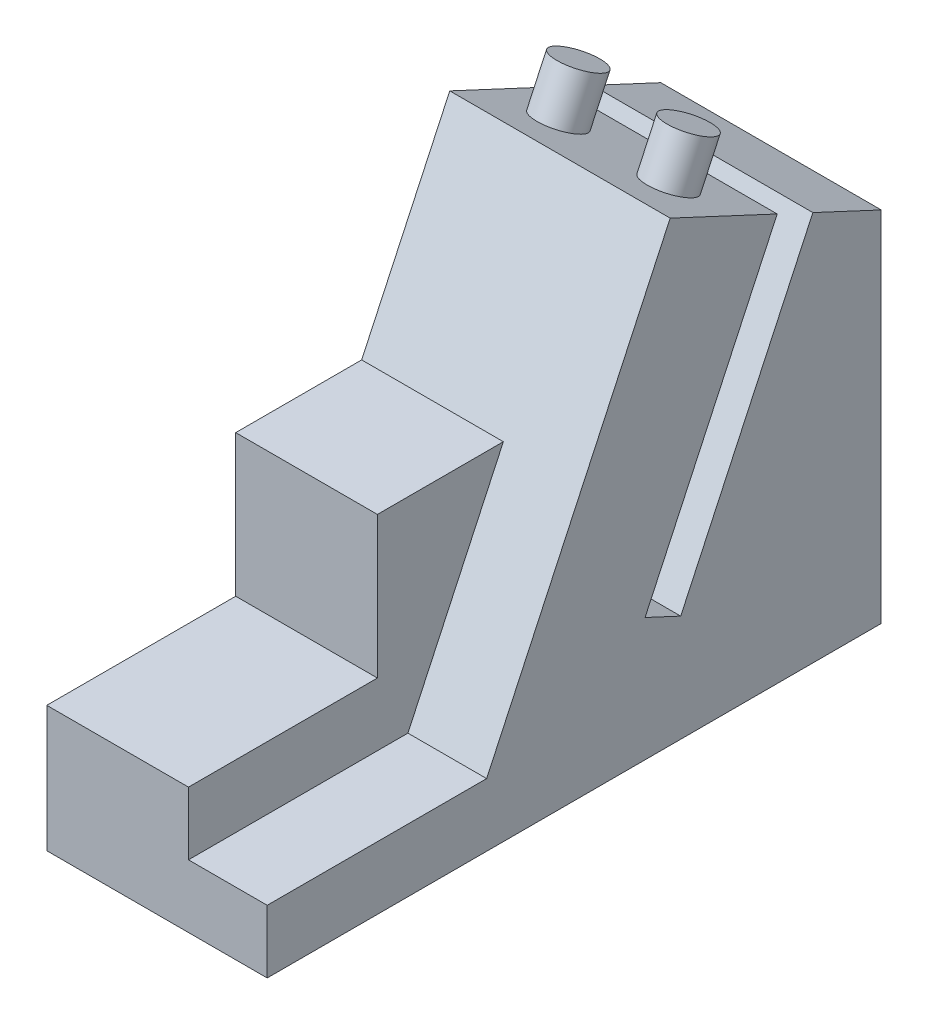
ISO-10303-21;
HEADER;
FILE_DESCRIPTION(('STEP AP214'),'2;1');
FILE_NAME('part.step','',(''),(''),'','','');
FILE_SCHEMA(('AUTOMOTIVE_DESIGN { 1 0 10303 214 1 1 1 1 }'));
ENDSEC;
DATA;
#1=APPLICATION_CONTEXT('core data for automotive mechanical design processes');
#2=APPLICATION_PROTOCOL_DEFINITION('international standard','automotive_design',2000,#1);
#3=PRODUCT_CONTEXT('',#1,'mechanical');
#4=PRODUCT('Part','Part','',(#3));
#5=PRODUCT_RELATED_PRODUCT_CATEGORY('part','',(#4));
#6=PRODUCT_DEFINITION_FORMATION('','',#4);
#7=PRODUCT_DEFINITION_CONTEXT('part definition',#1,'design');
#8=PRODUCT_DEFINITION('design','',#6,#7);
#9=PRODUCT_DEFINITION_SHAPE('','',#8);
#10=(LENGTH_UNIT() NAMED_UNIT(*) SI_UNIT(.MILLI.,.METRE.));
#11=(NAMED_UNIT(*) PLANE_ANGLE_UNIT() SI_UNIT($,.RADIAN.));
#12=(NAMED_UNIT(*) SI_UNIT($,.STERADIAN.) SOLID_ANGLE_UNIT());
#13=UNCERTAINTY_MEASURE_WITH_UNIT(LENGTH_MEASURE(1.E-05),#10,'distance_accuracy_value','');
#14=(GEOMETRIC_REPRESENTATION_CONTEXT(3) GLOBAL_UNCERTAINTY_ASSIGNED_CONTEXT((#13)) GLOBAL_UNIT_ASSIGNED_CONTEXT((#10,
#11,#12)) REPRESENTATION_CONTEXT('',''));
#15=CARTESIAN_POINT('',(0.,0.,0.));
#16=DIRECTION('',(0.,0.,1.));
#17=DIRECTION('',(1.,0.,0.));
#18=AXIS2_PLACEMENT_3D('',#15,#16,#17);
#19=CARTESIAN_POINT('',(0.,34.,0.));
#20=DIRECTION('',(0.,-1.,0.));
#21=DIRECTION('',(0.,0.,-1.));
#22=AXIS2_PLACEMENT_3D('',#19,#20,#21);
#23=PLANE('',#22);
#24=DIRECTION('',(0.,0.,-1.));
#25=VECTOR('',#24,1.);
#26=CARTESIAN_POINT('',(18.,34.,0.));
#27=LINE('',#26,#25);
#28=CARTESIAN_POINT('',(18.,34.,-24.));
#29=VERTEX_POINT('',#28);
#30=CARTESIAN_POINT('',(18.,34.,-40.));
#31=VERTEX_POINT('',#30);
#32=EDGE_CURVE('E108',#29,#31,#27,.T.);
#33=ORIENTED_EDGE('',*,*,#32,.T.);
#34=DIRECTION('',(1.,0.,0.));
#35=VECTOR('',#34,1.);
#36=CARTESIAN_POINT('',(0.,34.,-40.));
#37=LINE('',#36,#35);
#38=CARTESIAN_POINT('',(0.,34.,-40.));
#39=VERTEX_POINT('',#38);
#40=EDGE_CURVE('E232',#39,#31,#37,.T.);
#41=ORIENTED_EDGE('',*,*,#40,.F.);
#42=DIRECTION('',(0.,0.,-1.));
#43=VECTOR('',#42,1.);
#44=CARTESIAN_POINT('',(0.,34.,0.));
#45=LINE('',#44,#43);
#46=CARTESIAN_POINT('',(0.,34.,-24.));
#47=VERTEX_POINT('',#46);
#48=EDGE_CURVE('E299',#47,#39,#45,.T.);
#49=ORIENTED_EDGE('',*,*,#48,.F.);
#50=DIRECTION('',(1.,0.,0.));
#51=VECTOR('',#50,1.);
#52=CARTESIAN_POINT('',(0.,34.,-24.));
#53=LINE('',#52,#51);
#54=EDGE_CURVE('E217',#47,#29,#53,.T.);
#55=ORIENTED_EDGE('',*,*,#54,.T.);
#56=EDGE_LOOP('',(#33,#41,#49,#55));
#57=FACE_BOUND('',#56,.T.);
#58=ADVANCED_FACE('F92',(#57),#23,.F.);
#59=CARTESIAN_POINT('',(0.,16.,0.));
#60=DIRECTION('',(0.,-1.,0.));
#61=DIRECTION('',(0.,0.,-1.));
#62=AXIS2_PLACEMENT_3D('',#59,#60,#61);
#63=PLANE('',#62);
#64=DIRECTION('',(0.,0.,-1.));
#65=VECTOR('',#64,1.);
#66=CARTESIAN_POINT('',(18.,16.,0.));
#67=LINE('',#66,#65);
#68=CARTESIAN_POINT('',(18.,16.,0.));
#69=VERTEX_POINT('',#68);
#70=CARTESIAN_POINT('',(18.,16.,-24.));
#71=VERTEX_POINT('',#70);
#72=EDGE_CURVE('E195',#69,#71,#67,.T.);
#73=ORIENTED_EDGE('',*,*,#72,.T.);
#74=DIRECTION('',(1.,0.,0.));
#75=VECTOR('',#74,1.);
#76=CARTESIAN_POINT('',(0.,16.,-24.));
#77=LINE('',#76,#75);
#78=CARTESIAN_POINT('',(0.,16.,-24.));
#79=VERTEX_POINT('',#78);
#80=EDGE_CURVE('E205',#79,#71,#77,.T.);
#81=ORIENTED_EDGE('',*,*,#80,.F.);
#82=DIRECTION('',(0.,0.,-1.));
#83=VECTOR('',#82,1.);
#84=CARTESIAN_POINT('',(0.,16.,0.));
#85=LINE('',#84,#83);
#86=CARTESIAN_POINT('',(0.,16.,0.));
#87=VERTEX_POINT('',#86);
#88=EDGE_CURVE('E338',#87,#79,#85,.T.);
#89=ORIENTED_EDGE('',*,*,#88,.F.);
#90=DIRECTION('',(1.,0.,0.));
#91=VECTOR('',#90,1.);
#92=CARTESIAN_POINT('',(0.,16.,0.));
#93=LINE('',#92,#91);
#94=EDGE_CURVE('E208',#87,#69,#93,.T.);
#95=ORIENTED_EDGE('',*,*,#94,.T.);
#96=EDGE_LOOP('',(#73,#81,#89,#95));
#97=FACE_BOUND('',#96,.T.);
#98=ADVANCED_FACE('F204',(#97),#63,.F.);
#99=CARTESIAN_POINT('',(0.,0.,-24.));
#100=DIRECTION('',(0.,0.,-1.));
#101=DIRECTION('',(-1.,0.,0.));
#102=AXIS2_PLACEMENT_3D('',#99,#100,#101);
#103=PLANE('',#102);
#104=DIRECTION('',(0.,1.,0.));
#105=VECTOR('',#104,1.);
#106=CARTESIAN_POINT('',(18.,0.,-24.));
#107=LINE('',#106,#105);
#108=EDGE_CURVE('E191',#71,#29,#107,.T.);
#109=ORIENTED_EDGE('',*,*,#108,.T.);
#110=ORIENTED_EDGE('',*,*,#54,.F.);
#111=DIRECTION('',(0.,1.,0.));
#112=VECTOR('',#111,1.);
#113=CARTESIAN_POINT('',(0.,0.,-24.));
#114=LINE('',#113,#112);
#115=EDGE_CURVE('E214',#79,#47,#114,.T.);
#116=ORIENTED_EDGE('',*,*,#115,.F.);
#117=ORIENTED_EDGE('',*,*,#80,.T.);
#118=EDGE_LOOP('',(#109,#110,#116,#117));
#119=FACE_BOUND('',#118,.T.);
#120=ADVANCED_FACE('F212',(#119),#103,.F.);
#121=CARTESIAN_POINT('',(0.,58.,0.));
#122=DIRECTION('',(1.,0.,0.));
#123=DIRECTION('',(0.,0.,-1.));
#124=AXIS2_PLACEMENT_3D('',#121,#122,#123);
#125=PLANE('',#124);
#126=DIRECTION('',(0.,-0.906307787036651,0.422618261740697));
#127=VECTOR('',#126,1.);
#128=CARTESIAN_POINT('',(0.,-17.7006434618647,-37.9591524014413));
#129=LINE('',#128,#127);
#130=CARTESIAN_POINT('',(0.,49.5476347651861,-69.3175395364529));
#131=VERTEX_POINT('',#130);
#132=CARTESIAN_POINT('',(0.,13.5476347651861,-52.5304638428731));
#133=VERTEX_POINT('',#132);
#134=EDGE_CURVE('E336',#131,#133,#129,.T.);
#135=ORIENTED_EDGE('',*,*,#134,.F.);
#136=DIRECTION('',(0.,-0.422618261740697,-0.906307787036651));
#137=VECTOR('',#136,1.);
#138=CARTESIAN_POINT('',(0.,67.2482782270507,-31.3583871350116));
#139=LINE('',#138,#137);
#140=CARTESIAN_POINT('',(0.,45.4989369594061,-78.));
#141=VERTEX_POINT('',#140);
#142=EDGE_CURVE('E333',#131,#141,#139,.T.);
#143=ORIENTED_EDGE('',*,*,#142,.T.);
#144=DIRECTION('',(0.,-1.,0.));
#145=VECTOR('',#144,1.);
#146=CARTESIAN_POINT('',(0.,58.,-78.));
#147=LINE('',#146,#145);
#148=CARTESIAN_POINT('',(0.,0.,-78.));
#149=VERTEX_POINT('',#148);
#150=EDGE_CURVE('E244',#141,#149,#147,.T.);
#151=ORIENTED_EDGE('',*,*,#150,.T.);
#152=DIRECTION('',(0.,0.,1.));
#153=VECTOR('',#152,1.);
#154=CARTESIAN_POINT('',(0.,0.,0.));
#155=LINE('',#154,#153);
#156=CARTESIAN_POINT('',(0.,0.,0.));
#157=VERTEX_POINT('',#156);
#158=EDGE_CURVE('E227',#149,#157,#155,.T.);
#159=ORIENTED_EDGE('',*,*,#158,.T.);
#160=DIRECTION('',(0.,-1.,0.));
#161=VECTOR('',#160,1.);
#162=CARTESIAN_POINT('',(0.,58.,0.));
#163=LINE('',#162,#161);
#164=EDGE_CURVE('E253',#87,#157,#163,.T.);
#165=ORIENTED_EDGE('',*,*,#164,.F.);
#166=ORIENTED_EDGE('',*,*,#88,.T.);
#167=ORIENTED_EDGE('',*,*,#115,.T.);
#168=ORIENTED_EDGE('',*,*,#48,.T.);
#169=DIRECTION('',(0.,0.906307787036651,-0.422618261740697));
#170=VECTOR('',#169,1.);
#171=CARTESIAN_POINT('',(0.,-9.24827822705073,-19.8329966607083));
#172=LINE('',#171,#170);
#173=CARTESIAN_POINT('',(0.,58.,-51.1913837957199));
#174=VERTEX_POINT('',#173);
#175=EDGE_CURVE('E223',#39,#174,#172,.T.);
#176=ORIENTED_EDGE('',*,*,#175,.T.);
#177=CARTESIAN_POINT('',(0.,51.6607260738896,-64.7860006012697));
#178=VERTEX_POINT('',#177);
#179=EDGE_CURVE('E340',#174,#178,#139,.T.);
#180=ORIENTED_EDGE('',*,*,#179,.T.);
#181=DIRECTION('',(0.,-0.906307787036651,0.422618261740697));
#182=VECTOR('',#181,1.);
#183=CARTESIAN_POINT('',(0.,-15.5875521531612,-33.427613466258));
#184=LINE('',#183,#182);
#185=CARTESIAN_POINT('',(0.,15.6607260738896,-47.9989249076898));
#186=VERTEX_POINT('',#185);
#187=EDGE_CURVE('E348',#178,#186,#184,.T.);
#188=ORIENTED_EDGE('',*,*,#187,.T.);
#189=DIRECTION('',(0.,-0.422618261740697,-0.906307787036651));
#190=VECTOR('',#189,1.);
#191=CARTESIAN_POINT('',(0.,31.2482782270507,-14.5713114414317));
#192=LINE('',#191,#190);
#193=EDGE_CURVE('E343',#186,#133,#192,.T.);
#194=ORIENTED_EDGE('',*,*,#193,.T.);
#195=EDGE_LOOP('',(#135,#143,#151,#159,#165,#166,#167,#168,#176,#180,#188,#194));
#196=FACE_BOUND('',#195,.T.);
#197=ADVANCED_FACE('F94',(#196),#125,.F.);
#198=CARTESIAN_POINT('',(0.,58.,0.));
#199=DIRECTION('',(0.,0.,-1.));
#200=DIRECTION('',(-1.,0.,0.));
#201=AXIS2_PLACEMENT_3D('',#198,#199,#200);
#202=PLANE('',#201);
#203=DIRECTION('',(0.,-1.,0.));
#204=VECTOR('',#203,1.);
#205=CARTESIAN_POINT('',(28.,58.,0.));
#206=LINE('',#205,#204);
#207=CARTESIAN_POINT('',(28.,8.,0.));
#208=VERTEX_POINT('',#207);
#209=CARTESIAN_POINT('',(28.,0.,0.));
#210=VERTEX_POINT('',#209);
#211=EDGE_CURVE('E250',#208,#210,#206,.T.);
#212=ORIENTED_EDGE('',*,*,#211,.F.);
#213=DIRECTION('',(1.,0.,0.));
#214=VECTOR('',#213,1.);
#215=CARTESIAN_POINT('',(18.,8.,0.));
#216=LINE('',#215,#214);
#217=CARTESIAN_POINT('',(18.,8.,0.));
#218=VERTEX_POINT('',#217);
#219=EDGE_CURVE('E393',#218,#208,#216,.T.);
#220=ORIENTED_EDGE('',*,*,#219,.F.);
#221=DIRECTION('',(0.,-1.,0.));
#222=VECTOR('',#221,1.);
#223=CARTESIAN_POINT('',(18.,0.,0.));
#224=LINE('',#223,#222);
#225=EDGE_CURVE('E210',#69,#218,#224,.T.);
#226=ORIENTED_EDGE('',*,*,#225,.F.);
#227=ORIENTED_EDGE('',*,*,#94,.F.);
#228=ORIENTED_EDGE('',*,*,#164,.T.);
#229=DIRECTION('',(1.,0.,0.));
#230=VECTOR('',#229,1.);
#231=CARTESIAN_POINT('',(0.,0.,0.));
#232=LINE('',#231,#230);
#233=EDGE_CURVE('E231',#157,#210,#232,.T.);
#234=ORIENTED_EDGE('',*,*,#233,.T.);
#235=EDGE_LOOP('',(#212,#220,#226,#227,#228,#234));
#236=FACE_BOUND('',#235,.T.);
#237=ADVANCED_FACE('F386',(#236),#202,.F.);
#238=CARTESIAN_POINT('',(28.,58.,0.));
#239=DIRECTION('',(-1.,0.,0.));
#240=DIRECTION('',(0.,0.,1.));
#241=AXIS2_PLACEMENT_3D('',#238,#239,#240);
#242=PLANE('',#241);
#243=DIRECTION('',(0.,0.906307787036651,-0.422618261740697));
#244=VECTOR('',#243,1.);
#245=CARTESIAN_POINT('',(28.,-9.24827822705073,-19.8329966607083));
#246=LINE('',#245,#244);
#247=CARTESIAN_POINT('',(28.,8.,-27.8760008879701));
#248=VERTEX_POINT('',#247);
#249=CARTESIAN_POINT('',(28.,58.,-51.1913837957199));
#250=VERTEX_POINT('',#249);
#251=EDGE_CURVE('E280',#248,#250,#246,.T.);
#252=ORIENTED_EDGE('',*,*,#251,.F.);
#253=DIRECTION('',(0.,0.,-1.));
#254=VECTOR('',#253,1.);
#255=CARTESIAN_POINT('',(28.,8.,0.));
#256=LINE('',#255,#254);
#257=EDGE_CURVE('E404',#208,#248,#256,.T.);
#258=ORIENTED_EDGE('',*,*,#257,.F.);
#259=ORIENTED_EDGE('',*,*,#211,.T.);
#260=DIRECTION('',(0.,0.,-1.));
#261=VECTOR('',#260,1.);
#262=CARTESIAN_POINT('',(28.,0.,0.));
#263=LINE('',#262,#261);
#264=CARTESIAN_POINT('',(28.,0.,-78.));
#265=VERTEX_POINT('',#264);
#266=EDGE_CURVE('E236',#210,#265,#263,.T.);
#267=ORIENTED_EDGE('',*,*,#266,.T.);
#268=DIRECTION('',(0.,-1.,0.));
#269=VECTOR('',#268,1.);
#270=CARTESIAN_POINT('',(28.,58.,-78.));
#271=LINE('',#270,#269);
#272=CARTESIAN_POINT('',(28.,45.4989369594061,-78.));
#273=VERTEX_POINT('',#272);
#274=EDGE_CURVE('E247',#273,#265,#271,.T.);
#275=ORIENTED_EDGE('',*,*,#274,.F.);
#276=DIRECTION('',(0.,-0.422618261740697,-0.906307787036651));
#277=VECTOR('',#276,1.);
#278=CARTESIAN_POINT('',(28.,67.2482782270507,-31.3583871350116));
#279=LINE('',#278,#277);
#280=CARTESIAN_POINT('',(28.,49.5476347651861,-69.3175395364529));
#281=VERTEX_POINT('',#280);
#282=EDGE_CURVE('E116',#281,#273,#279,.T.);
#283=ORIENTED_EDGE('',*,*,#282,.F.);
#284=DIRECTION('',(0.,-0.906307787036651,0.422618261740697));
#285=VECTOR('',#284,1.);
#286=CARTESIAN_POINT('',(28.,-17.7006434618647,-37.9591524014413));
#287=LINE('',#286,#285);
#288=CARTESIAN_POINT('',(28.,13.5476347651861,-52.5304638428731));
#289=VERTEX_POINT('',#288);
#290=EDGE_CURVE('E293',#281,#289,#287,.T.);
#291=ORIENTED_EDGE('',*,*,#290,.T.);
#292=DIRECTION('',(0.,-0.422618261740697,-0.906307787036651));
#293=VECTOR('',#292,1.);
#294=CARTESIAN_POINT('',(28.,31.2482782270507,-14.5713114414317));
#295=LINE('',#294,#293);
#296=CARTESIAN_POINT('',(28.,15.6607260738896,-47.9989249076898));
#297=VERTEX_POINT('',#296);
#298=EDGE_CURVE('E288',#297,#289,#295,.T.);
#299=ORIENTED_EDGE('',*,*,#298,.F.);
#300=DIRECTION('',(0.,-0.906307787036651,0.422618261740697));
#301=VECTOR('',#300,1.);
#302=CARTESIAN_POINT('',(28.,-15.5875521531612,-33.427613466258));
#303=LINE('',#302,#301);
#304=CARTESIAN_POINT('',(28.,51.6607260738896,-64.7860006012697));
#305=VERTEX_POINT('',#304);
#306=EDGE_CURVE('E281',#305,#297,#303,.T.);
#307=ORIENTED_EDGE('',*,*,#306,.F.);
#308=EDGE_CURVE('E271',#250,#305,#279,.T.);
#309=ORIENTED_EDGE('',*,*,#308,.F.);
#310=EDGE_LOOP('',(#252,#258,#259,#267,#275,#283,#291,#299,#307,#309));
#311=FACE_BOUND('',#310,.T.);
#312=ADVANCED_FACE('F285',(#311),#242,.F.);
#313=CARTESIAN_POINT('',(0.,58.,-78.));
#314=DIRECTION('',(0.,0.,1.));
#315=DIRECTION('',(1.,0.,0.));
#316=AXIS2_PLACEMENT_3D('',#313,#314,#315);
#317=PLANE('',#316);
#318=ORIENTED_EDGE('',*,*,#150,.F.);
#319=DIRECTION('',(1.,0.,0.));
#320=VECTOR('',#319,1.);
#321=CARTESIAN_POINT('',(0.,45.4989369594061,-78.));
#322=LINE('',#321,#320);
#323=EDGE_CURVE('E221',#141,#273,#322,.T.);
#324=ORIENTED_EDGE('',*,*,#323,.T.);
#325=ORIENTED_EDGE('',*,*,#274,.T.);
#326=DIRECTION('',(-1.,0.,0.));
#327=VECTOR('',#326,1.);
#328=CARTESIAN_POINT('',(0.,0.,-78.));
#329=LINE('',#328,#327);
#330=EDGE_CURVE('E240',#265,#149,#329,.T.);
#331=ORIENTED_EDGE('',*,*,#330,.T.);
#332=EDGE_LOOP('',(#318,#324,#325,#331));
#333=FACE_BOUND('',#332,.T.);
#334=ADVANCED_FACE('F319',(#333),#317,.F.);
#335=CARTESIAN_POINT('',(0.,0.,0.));
#336=DIRECTION('',(0.,-1.,0.));
#337=DIRECTION('',(0.,0.,-1.));
#338=AXIS2_PLACEMENT_3D('',#335,#336,#337);
#339=PLANE('',#338);
#340=ORIENTED_EDGE('',*,*,#158,.F.);
#341=ORIENTED_EDGE('',*,*,#330,.F.);
#342=ORIENTED_EDGE('',*,*,#266,.F.);
#343=ORIENTED_EDGE('',*,*,#233,.F.);
#344=EDGE_LOOP('',(#340,#341,#342,#343));
#345=FACE_BOUND('',#344,.T.);
#346=ADVANCED_FACE('F329',(#345),#339,.T.);
#347=CARTESIAN_POINT('',(0.,-9.24827822705073,-19.8329966607083));
#348=DIRECTION('',(0.,-0.422618261740697,-0.906307787036651));
#349=DIRECTION('',(0.,0.906307787036651,-0.422618261740697));
#350=AXIS2_PLACEMENT_3D('',#347,#348,#349);
#351=PLANE('',#350);
#352=ORIENTED_EDGE('',*,*,#251,.T.);
#353=DIRECTION('',(1.,0.,0.));
#354=VECTOR('',#353,1.);
#355=CARTESIAN_POINT('',(0.,58.,-51.1913837957199));
#356=LINE('',#355,#354);
#357=EDGE_CURVE('E276',#174,#250,#356,.T.);
#358=ORIENTED_EDGE('',*,*,#357,.F.);
#359=ORIENTED_EDGE('',*,*,#175,.F.);
#360=ORIENTED_EDGE('',*,*,#40,.T.);
#361=DIRECTION('',(0.,0.906307787036651,-0.422618261740697));
#362=VECTOR('',#361,1.);
#363=CARTESIAN_POINT('',(18.,-9.24827822705073,-19.8329966607083));
#364=LINE('',#363,#362);
#365=CARTESIAN_POINT('',(18.,8.,-27.8760008879701));
#366=VERTEX_POINT('',#365);
#367=EDGE_CURVE('E399',#366,#31,#364,.T.);
#368=ORIENTED_EDGE('',*,*,#367,.F.);
#369=DIRECTION('',(1.,0.,0.));
#370=VECTOR('',#369,1.);
#371=CARTESIAN_POINT('',(18.,8.,-27.8760008879701));
#372=LINE('',#371,#370);
#373=EDGE_CURVE('E358',#366,#248,#372,.T.);
#374=ORIENTED_EDGE('',*,*,#373,.T.);
#375=EDGE_LOOP('',(#352,#358,#359,#360,#368,#374));
#376=FACE_BOUND('',#375,.T.);
#377=ADVANCED_FACE('F265',(#376),#351,.F.);
#378=CARTESIAN_POINT('',(0.,67.2482782270507,-31.3583871350116));
#379=DIRECTION('',(0.,-0.906307787036651,0.422618261740697));
#380=DIRECTION('',(0.,-0.422618261740697,-0.906307787036651));
#381=AXIS2_PLACEMENT_3D('',#378,#379,#380);
#382=PLANE('',#381);
#383=CARTESIAN_POINT('',(21.,54.8303630369448,-57.9886921984948));
#384=DIRECTION('',(0.,-0.906307787036651,0.422618261740697));
#385=DIRECTION('',(0.,-0.422618261740697,-0.906307787036651));
#386=AXIS2_PLACEMENT_3D('',#383,#384,#385);
#387=CIRCLE('',#386,3.);
#388=CARTESIAN_POINT('',(21.,53.5625082517227,-60.7076155596047));
#389=VERTEX_POINT('',#388);
#390=EDGE_CURVE('E13',#389,#389,#387,.F.);
#391=ORIENTED_EDGE('',*,*,#390,.F.);
#392=EDGE_LOOP('',(#391));
#393=FACE_BOUND('',#392,.T.);
#394=CARTESIAN_POINT('',(7.,54.8303630369448,-57.9886921984948));
#395=DIRECTION('',(0.,-0.906307787036651,0.422618261740697));
#396=DIRECTION('',(0.,-0.422618261740697,-0.906307787036651));
#397=AXIS2_PLACEMENT_3D('',#394,#395,#396);
#398=CIRCLE('',#397,3.);
#399=CARTESIAN_POINT('',(7.,53.5625082517227,-60.7076155596047));
#400=VERTEX_POINT('',#399);
#401=EDGE_CURVE('E101',#400,#400,#398,.F.);
#402=ORIENTED_EDGE('',*,*,#401,.F.);
#403=EDGE_LOOP('',(#402));
#404=FACE_BOUND('',#403,.T.);
#405=ORIENTED_EDGE('',*,*,#308,.T.);
#406=DIRECTION('',(1.,0.,0.));
#407=VECTOR('',#406,1.);
#408=CARTESIAN_POINT('',(0.,51.6607260738896,-64.7860006012697));
#409=LINE('',#408,#407);
#410=EDGE_CURVE('E274',#178,#305,#409,.T.);
#411=ORIENTED_EDGE('',*,*,#410,.F.);
#412=ORIENTED_EDGE('',*,*,#179,.F.);
#413=ORIENTED_EDGE('',*,*,#357,.T.);
#414=EDGE_LOOP('',(#405,#411,#412,#413));
#415=FACE_BOUND('',#414,.T.);
#416=ADVANCED_FACE('F261',(#393,#404,#415),#382,.F.);
#417=CARTESIAN_POINT('',(0.,-15.5875521531612,-33.427613466258));
#418=DIRECTION('',(0.,0.422618261740697,0.906307787036651));
#419=DIRECTION('',(0.,-0.906307787036651,0.422618261740697));
#420=AXIS2_PLACEMENT_3D('',#417,#418,#419);
#421=PLANE('',#420);
#422=ORIENTED_EDGE('',*,*,#306,.T.);
#423=DIRECTION('',(1.,0.,0.));
#424=VECTOR('',#423,1.);
#425=CARTESIAN_POINT('',(0.,15.6607260738896,-47.9989249076898));
#426=LINE('',#425,#424);
#427=EDGE_CURVE('E307',#186,#297,#426,.T.);
#428=ORIENTED_EDGE('',*,*,#427,.F.);
#429=ORIENTED_EDGE('',*,*,#187,.F.);
#430=ORIENTED_EDGE('',*,*,#410,.T.);
#431=EDGE_LOOP('',(#422,#428,#429,#430));
#432=FACE_BOUND('',#431,.T.);
#433=ADVANCED_FACE('F264',(#432),#421,.F.);
#434=CARTESIAN_POINT('',(0.,31.2482782270507,-14.5713114414317));
#435=DIRECTION('',(0.,-0.906307787036651,0.422618261740697));
#436=DIRECTION('',(0.,-0.422618261740697,-0.906307787036651));
#437=AXIS2_PLACEMENT_3D('',#434,#435,#436);
#438=PLANE('',#437);
#439=ORIENTED_EDGE('',*,*,#298,.T.);
#440=DIRECTION('',(1.,0.,0.));
#441=VECTOR('',#440,1.);
#442=CARTESIAN_POINT('',(0.,13.5476347651861,-52.5304638428731));
#443=LINE('',#442,#441);
#444=EDGE_CURVE('E310',#133,#289,#443,.T.);
#445=ORIENTED_EDGE('',*,*,#444,.F.);
#446=ORIENTED_EDGE('',*,*,#193,.F.);
#447=ORIENTED_EDGE('',*,*,#427,.T.);
#448=EDGE_LOOP('',(#439,#445,#446,#447));
#449=FACE_BOUND('',#448,.T.);
#450=ADVANCED_FACE('F365',(#449),#438,.F.);
#451=CARTESIAN_POINT('',(0.,-17.7006434618647,-37.9591524014413));
#452=DIRECTION('',(0.,0.422618261740697,0.906307787036651));
#453=DIRECTION('',(0.,-0.906307787036651,0.422618261740697));
#454=AXIS2_PLACEMENT_3D('',#451,#452,#453);
#455=PLANE('',#454);
#456=ORIENTED_EDGE('',*,*,#290,.F.);
#457=DIRECTION('',(1.,0.,0.));
#458=VECTOR('',#457,1.);
#459=CARTESIAN_POINT('',(0.,49.5476347651861,-69.3175395364529));
#460=LINE('',#459,#458);
#461=EDGE_CURVE('E313',#131,#281,#460,.T.);
#462=ORIENTED_EDGE('',*,*,#461,.F.);
#463=ORIENTED_EDGE('',*,*,#134,.T.);
#464=ORIENTED_EDGE('',*,*,#444,.T.);
#465=EDGE_LOOP('',(#456,#462,#463,#464));
#466=FACE_BOUND('',#465,.T.);
#467=ADVANCED_FACE('F362',(#466),#455,.T.);
#468=ORIENTED_EDGE('',*,*,#282,.T.);
#469=ORIENTED_EDGE('',*,*,#323,.F.);
#470=ORIENTED_EDGE('',*,*,#142,.F.);
#471=ORIENTED_EDGE('',*,*,#461,.T.);
#472=EDGE_LOOP('',(#468,#469,#470,#471));
#473=FACE_BOUND('',#472,.T.);
#474=ADVANCED_FACE('F268',(#473),#382,.F.);
#475=CARTESIAN_POINT('',(18.,8.,0.));
#476=DIRECTION('',(0.,-1.,0.));
#477=DIRECTION('',(0.,0.,-1.));
#478=AXIS2_PLACEMENT_3D('',#475,#476,#477);
#479=PLANE('',#478);
#480=ORIENTED_EDGE('',*,*,#257,.T.);
#481=ORIENTED_EDGE('',*,*,#373,.F.);
#482=DIRECTION('',(0.,0.,-1.));
#483=VECTOR('',#482,1.);
#484=CARTESIAN_POINT('',(18.,8.,0.));
#485=LINE('',#484,#483);
#486=EDGE_CURVE('E396',#218,#366,#485,.T.);
#487=ORIENTED_EDGE('',*,*,#486,.F.);
#488=ORIENTED_EDGE('',*,*,#219,.T.);
#489=EDGE_LOOP('',(#480,#481,#487,#488));
#490=FACE_BOUND('',#489,.T.);
#491=ADVANCED_FACE('F423',(#490),#479,.F.);
#492=CARTESIAN_POINT('',(18.,0.,0.));
#493=DIRECTION('',(1.,0.,0.));
#494=DIRECTION('',(0.,0.,-1.));
#495=AXIS2_PLACEMENT_3D('',#492,#493,#494);
#496=PLANE('',#495);
#497=ORIENTED_EDGE('',*,*,#32,.F.);
#498=ORIENTED_EDGE('',*,*,#108,.F.);
#499=ORIENTED_EDGE('',*,*,#72,.F.);
#500=ORIENTED_EDGE('',*,*,#225,.T.);
#501=ORIENTED_EDGE('',*,*,#486,.T.);
#502=ORIENTED_EDGE('',*,*,#367,.T.);
#503=EDGE_LOOP('',(#497,#498,#499,#500,#501,#502));
#504=FACE_BOUND('',#503,.T.);
#505=ADVANCED_FACE('F193',(#504),#496,.T.);
#506=CARTESIAN_POINT('',(7.,60.2682097591647,-60.524401768939));
#507=DIRECTION('',(0.,-0.906307787036651,0.422618261740697));
#508=DIRECTION('',(0.,-0.422618261740697,-0.906307787036651));
#509=AXIS2_PLACEMENT_3D('',#506,#507,#508);
#510=CYLINDRICAL_SURFACE('',#509,3.);
#511=CARTESIAN_POINT('',(7.,60.2682097591647,-60.524401768939));
#512=DIRECTION('',(0.,0.906307787036651,-0.422618261740697));
#513=DIRECTION('',(0.,0.422618261740697,0.906307787036651));
#514=AXIS2_PLACEMENT_3D('',#511,#512,#513);
#515=CIRCLE('',#514,3.);
#516=CARTESIAN_POINT('',(7.,59.0003549739426,-63.2433251300489));
#517=VERTEX_POINT('',#516);
#518=EDGE_CURVE('E408',#517,#517,#515,.T.);
#519=CARTESIAN_POINT('',(7.,59.0003549739426,-63.2433251300489));
#520=CARTESIAN_POINT('',(7.,58.9437107372528,-63.2169114886901));
#521=CARTESIAN_POINT('',(7.,58.887066500563,-63.1904978473313));
#522=CARTESIAN_POINT('',(7.,58.7737780271835,-63.1376705646138));
#523=CARTESIAN_POINT('',(7.,58.7171337904937,-63.111256923255));
#524=CARTESIAN_POINT('',(7.,58.6038453171141,-63.0584296405374));
#525=CARTESIAN_POINT('',(7.,58.5472010804243,-63.0320159991786));
#526=CARTESIAN_POINT('',(7.,58.4339126070447,-62.979188716461));
#527=CARTESIAN_POINT('',(7.,58.3772683703549,-62.9527750751022));
#528=CARTESIAN_POINT('',(7.,58.2639798969753,-62.8999477923846));
#529=CARTESIAN_POINT('',(7.,58.2073356602855,-62.8735341510258));
#530=CARTESIAN_POINT('',(7.,58.094047186906,-62.8207068683082));
#531=CARTESIAN_POINT('',(7.,58.0374029502162,-62.7942932269494));
#532=CARTESIAN_POINT('',(7.,57.9241144768366,-62.7414659442318));
#533=CARTESIAN_POINT('',(7.,57.8674702401468,-62.7150523028731));
#534=CARTESIAN_POINT('',(7.,57.7541817667672,-62.6622250201555));
#535=CARTESIAN_POINT('',(7.,57.6975375300774,-62.6358113787967));
#536=CARTESIAN_POINT('',(7.,57.5842490566978,-62.5829840960791));
#537=CARTESIAN_POINT('',(7.,57.5276048200081,-62.5565704547203));
#538=CARTESIAN_POINT('',(7.,57.4143163466285,-62.5037431720027));
#539=CARTESIAN_POINT('',(7.,57.3576721099387,-62.4773295306439));
#540=CARTESIAN_POINT('',(7.,57.2443836365591,-62.4245022479263));
#541=CARTESIAN_POINT('',(7.,57.1877393998693,-62.3980886065675));
#542=CARTESIAN_POINT('',(7.,57.0744509264897,-62.34526132385));
#543=CARTESIAN_POINT('',(7.,57.0178066897999,-62.3188476824912));
#544=CARTESIAN_POINT('',(7.,56.9045182164204,-62.2660203997736));
#545=CARTESIAN_POINT('',(7.,56.8478739797306,-62.2396067584148));
#546=CARTESIAN_POINT('',(7.,56.734585506351,-62.1867794756972));
#547=CARTESIAN_POINT('',(7.,56.6779412696612,-62.1603658343384));
#548=CARTESIAN_POINT('',(7.,56.5646527962816,-62.1075385516208));
#549=CARTESIAN_POINT('',(7.,56.5080085595918,-62.081124910262));
#550=CARTESIAN_POINT('',(7.,56.3947200862122,-62.0282976275444));
#551=CARTESIAN_POINT('',(7.,56.3380758495224,-62.0018839861856));
#552=CARTESIAN_POINT('',(7.,56.2247873761429,-61.949056703468));
#553=CARTESIAN_POINT('',(7.,56.1681431394531,-61.9226430621093));
#554=CARTESIAN_POINT('',(7.,56.0548546660735,-61.8698157793917));
#555=CARTESIAN_POINT('',(7.,55.9982104293837,-61.8434021380329));
#556=CARTESIAN_POINT('',(7.,55.8849219560041,-61.7905748553153));
#557=CARTESIAN_POINT('',(7.,55.8282777193143,-61.7641612139565));
#558=CARTESIAN_POINT('',(7.,55.7149892459348,-61.7113339312389));
#559=CARTESIAN_POINT('',(7.,55.658345009245,-61.6849202898801));
#560=CARTESIAN_POINT('',(7.,55.5450565358654,-61.6320930071625));
#561=CARTESIAN_POINT('',(7.,55.4884122991756,-61.6056793658037));
#562=CARTESIAN_POINT('',(7.,55.375123825796,-61.5528520830861));
#563=CARTESIAN_POINT('',(7.,55.3184795891062,-61.5264384417274));
#564=CARTESIAN_POINT('',(7.,55.2051911157266,-61.4736111590098));
#565=CARTESIAN_POINT('',(7.,55.1485468790368,-61.447197517651));
#566=CARTESIAN_POINT('',(7.,55.0352584056573,-61.3943702349334));
#567=CARTESIAN_POINT('',(7.,54.9786141689675,-61.3679565935746));
#568=CARTESIAN_POINT('',(7.,54.8653256955879,-61.315129310857));
#569=CARTESIAN_POINT('',(7.,54.8086814588981,-61.2887156694982));
#570=CARTESIAN_POINT('',(7.,54.6953929855185,-61.2358883867806));
#571=CARTESIAN_POINT('',(7.,54.6387487488287,-61.2094747454218));
#572=CARTESIAN_POINT('',(7.,54.5254602754491,-61.1566474627042));
#573=CARTESIAN_POINT('',(7.,54.4688160387593,-61.1302338213454));
#574=CARTESIAN_POINT('',(7.,54.3555275653798,-61.0774065386279));
#575=CARTESIAN_POINT('',(7.,54.29888332869,-61.0509928972691));
#576=CARTESIAN_POINT('',(7.,54.1855948553104,-60.9981656145515));
#577=CARTESIAN_POINT('',(7.,54.1289506186206,-60.9717519731927));
#578=CARTESIAN_POINT('',(7.,54.015662145241,-60.9189246904751));
#579=CARTESIAN_POINT('',(7.,53.9590179085512,-60.8925110491163));
#580=CARTESIAN_POINT('',(7.,53.8457294351716,-60.8396837663987));
#581=CARTESIAN_POINT('',(7.,53.7890851984819,-60.8132701250399));
#582=CARTESIAN_POINT('',(7.,53.6757967251023,-60.7604428423223));
#583=CARTESIAN_POINT('',(7.,53.6191524884125,-60.7340292009635));
#584=CARTESIAN_POINT('',(7.,53.5625082517227,-60.7076155596047));
#585=B_SPLINE_CURVE_WITH_KNOTS('',3,(#519,#520,#521,#522,#523,#524,#525,#526,#527,#528,#529,
#530,#531,#532,#533,#534,#535,#536,#537,#538,#539,#540,#541,#542,#543,#544,#545,#546,#547,#548,
#549,#550,#551,#552,#553,#554,#555,#556,#557,#558,#559,#560,#561,#562,#563,#564,#565,#566,#567,
#568,#569,#570,#571,#572,#573,#574,#575,#576,#577,#578,#579,#580,#581,#582,#583,#584),
.UNSPECIFIED.,.F.,.F.,(4,2,2,2,2,2,2,2,2,2,2,2,2,2,2,2,2,2,2,2,2,2,2,2,2,2,2,2,2,2,2,2,4),(0.,
0.187500000000003,0.374999999999999,0.562500000000002,0.750000000000005,0.937500000000002,1.125,
1.31250000000001,1.5,1.68750000000001,1.875,2.06250000000001,2.25000000000001,2.43750000000001,
2.625,2.81250000000001,3.00000000000001,3.18750000000001,3.37500000000001,3.56250000000001,
3.75000000000001,3.93750000000001,4.12500000000001,4.31250000000001,4.50000000000002,
4.68750000000001,4.87500000000001,5.06250000000001,5.25000000000002,5.43750000000001,
5.62500000000001,5.81250000000001,6.00000000000002),.UNSPECIFIED.);
#586=EDGE_CURVE('BSEAM259',#517,#400,#585,.T.);
#587=ORIENTED_EDGE('',*,*,#518,.F.);
#588=ORIENTED_EDGE('',*,*,#401,.T.);
#589=ORIENTED_EDGE('',*,*,#586,.T.);
#590=ORIENTED_EDGE('',*,*,#586,.F.);
#591=EDGE_LOOP('',(#587,#589,#588,#590));
#592=FACE_BOUND('',#591,.T.);
#593=ADVANCED_FACE('F259',(#592),#510,.T.);
#594=CARTESIAN_POINT('',(7.,60.2682097591647,-60.524401768939));
#595=DIRECTION('',(0.,0.906307787036651,-0.422618261740697));
#596=DIRECTION('',(0.,0.422618261740697,0.906307787036651));
#597=AXIS2_PLACEMENT_3D('',#594,#595,#596);
#598=PLANE('',#597);
#599=ORIENTED_EDGE('',*,*,#518,.T.);
#600=EDGE_LOOP('',(#599));
#601=FACE_BOUND('',#600,.T.);
#602=ADVANCED_FACE('F458',(#601),#598,.T.);
#603=CARTESIAN_POINT('',(21.,60.2682097591647,-60.524401768939));
#604=DIRECTION('',(0.,-0.906307787036651,0.422618261740697));
#605=DIRECTION('',(0.,-0.422618261740697,-0.906307787036651));
#606=AXIS2_PLACEMENT_3D('',#603,#604,#605);
#607=CYLINDRICAL_SURFACE('',#606,3.);
#608=CARTESIAN_POINT('',(21.,60.2682097591647,-60.524401768939));
#609=DIRECTION('',(0.,0.906307787036651,-0.422618261740697));
#610=DIRECTION('',(0.,-0.422618261740697,-0.906307787036651));
#611=AXIS2_PLACEMENT_3D('',#608,#609,#610);
#612=CIRCLE('',#611,3.);
#613=CARTESIAN_POINT('',(21.,59.0003549739426,-63.2433251300489));
#614=VERTEX_POINT('',#613);
#615=EDGE_CURVE('E607',#614,#614,#612,.T.);
#616=CARTESIAN_POINT('',(21.,59.0003549739426,-63.2433251300489));
#617=CARTESIAN_POINT('',(21.,58.9437107372528,-63.2169114886901));
#618=CARTESIAN_POINT('',(21.,58.887066500563,-63.1904978473313));
#619=CARTESIAN_POINT('',(21.,58.7737780271835,-63.1376705646138));
#620=CARTESIAN_POINT('',(21.,58.7171337904937,-63.111256923255));
#621=CARTESIAN_POINT('',(21.,58.6038453171141,-63.0584296405374));
#622=CARTESIAN_POINT('',(21.,58.5472010804243,-63.0320159991786));
#623=CARTESIAN_POINT('',(21.,58.4339126070447,-62.979188716461));
#624=CARTESIAN_POINT('',(21.,58.3772683703549,-62.9527750751022));
#625=CARTESIAN_POINT('',(21.,58.2639798969753,-62.8999477923846));
#626=CARTESIAN_POINT('',(21.,58.2073356602855,-62.8735341510258));
#627=CARTESIAN_POINT('',(21.,58.094047186906,-62.8207068683082));
#628=CARTESIAN_POINT('',(21.,58.0374029502162,-62.7942932269494));
#629=CARTESIAN_POINT('',(21.,57.9241144768366,-62.7414659442319));
#630=CARTESIAN_POINT('',(21.,57.8674702401468,-62.7150523028731));
#631=CARTESIAN_POINT('',(21.,57.7541817667672,-62.6622250201555));
#632=CARTESIAN_POINT('',(21.,57.6975375300774,-62.6358113787967));
#633=CARTESIAN_POINT('',(21.,57.5842490566978,-62.5829840960791));
#634=CARTESIAN_POINT('',(21.,57.5276048200081,-62.5565704547203));
#635=CARTESIAN_POINT('',(21.,57.4143163466285,-62.5037431720027));
#636=CARTESIAN_POINT('',(21.,57.3576721099387,-62.4773295306439));
#637=CARTESIAN_POINT('',(21.,57.2443836365591,-62.4245022479263));
#638=CARTESIAN_POINT('',(21.,57.1877393998693,-62.3980886065675));
#639=CARTESIAN_POINT('',(21.,57.0744509264897,-62.3452613238499));
#640=CARTESIAN_POINT('',(21.,57.0178066897999,-62.3188476824912));
#641=CARTESIAN_POINT('',(21.,56.9045182164204,-62.2660203997736));
#642=CARTESIAN_POINT('',(21.,56.8478739797306,-62.2396067584148));
#643=CARTESIAN_POINT('',(21.,56.734585506351,-62.1867794756972));
#644=CARTESIAN_POINT('',(21.,56.6779412696612,-62.1603658343384));
#645=CARTESIAN_POINT('',(21.,56.5646527962816,-62.1075385516208));
#646=CARTESIAN_POINT('',(21.,56.5080085595918,-62.081124910262));
#647=CARTESIAN_POINT('',(21.,56.3947200862122,-62.0282976275444));
#648=CARTESIAN_POINT('',(21.,56.3380758495224,-62.0018839861856));
#649=CARTESIAN_POINT('',(21.,56.2247873761429,-61.949056703468));
#650=CARTESIAN_POINT('',(21.,56.1681431394531,-61.9226430621093));
#651=CARTESIAN_POINT('',(21.,56.0548546660735,-61.8698157793917));
#652=CARTESIAN_POINT('',(21.,55.9982104293837,-61.8434021380329));
#653=CARTESIAN_POINT('',(21.,55.8849219560041,-61.7905748553153));
#654=CARTESIAN_POINT('',(21.,55.8282777193143,-61.7641612139565));
#655=CARTESIAN_POINT('',(21.,55.7149892459348,-61.7113339312389));
#656=CARTESIAN_POINT('',(21.,55.658345009245,-61.6849202898801));
#657=CARTESIAN_POINT('',(21.,55.5450565358654,-61.6320930071625));
#658=CARTESIAN_POINT('',(21.,55.4884122991756,-61.6056793658037));
#659=CARTESIAN_POINT('',(21.,55.375123825796,-61.5528520830861));
#660=CARTESIAN_POINT('',(21.,55.3184795891062,-61.5264384417273));
#661=CARTESIAN_POINT('',(21.,55.2051911157266,-61.4736111590098));
#662=CARTESIAN_POINT('',(21.,55.1485468790368,-61.447197517651));
#663=CARTESIAN_POINT('',(21.,55.0352584056573,-61.3943702349334));
#664=CARTESIAN_POINT('',(21.,54.9786141689675,-61.3679565935746));
#665=CARTESIAN_POINT('',(21.,54.8653256955879,-61.315129310857));
#666=CARTESIAN_POINT('',(21.,54.8086814588981,-61.2887156694982));
#667=CARTESIAN_POINT('',(21.,54.6953929855185,-61.2358883867806));
#668=CARTESIAN_POINT('',(21.,54.6387487488287,-61.2094747454218));
#669=CARTESIAN_POINT('',(21.,54.5254602754491,-61.1566474627042));
#670=CARTESIAN_POINT('',(21.,54.4688160387593,-61.1302338213454));
#671=CARTESIAN_POINT('',(21.,54.3555275653798,-61.0774065386278));
#672=CARTESIAN_POINT('',(21.,54.29888332869,-61.0509928972691));
#673=CARTESIAN_POINT('',(21.,54.1855948553104,-60.9981656145515));
#674=CARTESIAN_POINT('',(21.,54.1289506186206,-60.9717519731927));
#675=CARTESIAN_POINT('',(21.,54.015662145241,-60.9189246904751));
#676=CARTESIAN_POINT('',(21.,53.9590179085512,-60.8925110491163));
#677=CARTESIAN_POINT('',(21.,53.8457294351716,-60.8396837663987));
#678=CARTESIAN_POINT('',(21.,53.7890851984819,-60.8132701250399));
#679=CARTESIAN_POINT('',(21.,53.6757967251023,-60.7604428423223));
#680=CARTESIAN_POINT('',(21.,53.6191524884125,-60.7340292009635));
#681=CARTESIAN_POINT('',(21.,53.5625082517227,-60.7076155596047));
#682=B_SPLINE_CURVE_WITH_KNOTS('',3,(#616,#617,#618,#619,#620,#621,#622,#623,#624,#625,#626,
#627,#628,#629,#630,#631,#632,#633,#634,#635,#636,#637,#638,#639,#640,#641,#642,#643,#644,#645,
#646,#647,#648,#649,#650,#651,#652,#653,#654,#655,#656,#657,#658,#659,#660,#661,#662,#663,#664,
#665,#666,#667,#668,#669,#670,#671,#672,#673,#674,#675,#676,#677,#678,#679,#680,#681),
.UNSPECIFIED.,.F.,.F.,(4,2,2,2,2,2,2,2,2,2,2,2,2,2,2,2,2,2,2,2,2,2,2,2,2,2,2,2,2,2,2,2,4),(0.,
0.187499999999997,0.374999999999993,0.562499999999996,0.749999999999998,0.937500000000001,1.125,
1.3125,1.5,1.6875,1.875,2.0625,2.25,2.4375,2.625,2.8125,3.,3.1875,3.375,3.56250000000001,3.75,
3.93750000000001,4.125,4.31250000000001,4.50000000000001,4.68750000000001,4.87500000000001,
5.06250000000001,5.25000000000001,5.43750000000001,5.62500000000001,5.81250000000001,
6.00000000000001),.UNSPECIFIED.);
#683=EDGE_CURVE('BSEAM468',#614,#389,#682,.T.);
#684=ORIENTED_EDGE('',*,*,#615,.F.);
#685=ORIENTED_EDGE('',*,*,#390,.T.);
#686=ORIENTED_EDGE('',*,*,#683,.T.);
#687=ORIENTED_EDGE('',*,*,#683,.F.);
#688=EDGE_LOOP('',(#684,#686,#685,#687));
#689=FACE_BOUND('',#688,.T.);
#690=ADVANCED_FACE('F468',(#689),#607,.T.);
#691=CARTESIAN_POINT('',(21.,60.2682097591647,-60.524401768939));
#692=DIRECTION('',(0.,-0.906307787036651,0.422618261740697));
#693=DIRECTION('',(0.,-0.422618261740697,-0.906307787036651));
#694=AXIS2_PLACEMENT_3D('',#691,#692,#693);
#695=PLANE('',#694);
#696=ORIENTED_EDGE('',*,*,#615,.T.);
#697=EDGE_LOOP('',(#696));
#698=FACE_BOUND('',#697,.T.);
#699=ADVANCED_FACE('F479',(#698),#695,.F.);
#700=CLOSED_SHELL('',(#58,#98,#120,#197,#237,#312,#334,#346,#377,#416,#433,#450,#467,#474,#491,
#505,#593,#602,#690,#699));
#701=MANIFOLD_SOLID_BREP('B2',#700);
#702=ADVANCED_BREP_SHAPE_REPRESENTATION('',(#18,#701),#14);
#703=SHAPE_DEFINITION_REPRESENTATION(#9,#702);
ENDSEC;
END-ISO-10303-21;
